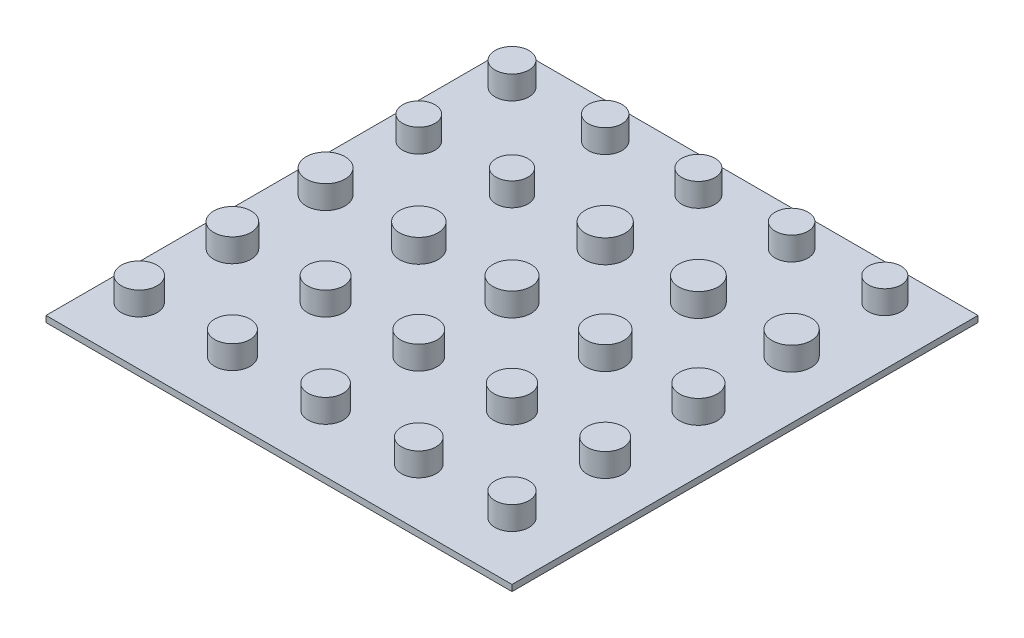
ISO-10303-21;
HEADER;
FILE_DESCRIPTION(('STEP AP214'),'2;1');
FILE_NAME('part.step','',(''),(''),'','','');
FILE_SCHEMA(('AUTOMOTIVE_DESIGN { 1 0 10303 214 1 1 1 1 }'));
ENDSEC;
DATA;
#1=APPLICATION_CONTEXT('core data for automotive mechanical design processes');
#2=APPLICATION_PROTOCOL_DEFINITION('international standard','automotive_design',2000,#1);
#3=PRODUCT_CONTEXT('',#1,'mechanical');
#4=PRODUCT('Part','Part','',(#3));
#5=PRODUCT_RELATED_PRODUCT_CATEGORY('part','',(#4));
#6=PRODUCT_DEFINITION_FORMATION('','',#4);
#7=PRODUCT_DEFINITION_CONTEXT('part definition',#1,'design');
#8=PRODUCT_DEFINITION('design','',#6,#7);
#9=PRODUCT_DEFINITION_SHAPE('','',#8);
#10=(LENGTH_UNIT() NAMED_UNIT(*) SI_UNIT(.MILLI.,.METRE.));
#11=(NAMED_UNIT(*) PLANE_ANGLE_UNIT() SI_UNIT($,.RADIAN.));
#12=(NAMED_UNIT(*) SI_UNIT($,.STERADIAN.) SOLID_ANGLE_UNIT());
#13=UNCERTAINTY_MEASURE_WITH_UNIT(LENGTH_MEASURE(1.E-05),#10,'distance_accuracy_value','');
#14=(GEOMETRIC_REPRESENTATION_CONTEXT(3) GLOBAL_UNCERTAINTY_ASSIGNED_CONTEXT((#13)) GLOBAL_UNIT_ASSIGNED_CONTEXT((#10,
#11,#12)) REPRESENTATION_CONTEXT('',''));
#15=CARTESIAN_POINT('',(0.,0.,0.));
#16=DIRECTION('',(0.,0.,1.));
#17=DIRECTION('',(1.,0.,0.));
#18=AXIS2_PLACEMENT_3D('',#15,#16,#17);
#19=CARTESIAN_POINT('',(-19.05,0.508,19.05));
#20=DIRECTION('',(1.,0.,0.));
#21=DIRECTION('',(0.,0.,-1.));
#22=AXIS2_PLACEMENT_3D('',#19,#20,#21);
#23=PLANE('',#22);
#24=DIRECTION('',(0.,0.,1.));
#25=VECTOR('',#24,1.);
#26=CARTESIAN_POINT('',(-19.05,0.,19.05));
#27=LINE('',#26,#25);
#28=CARTESIAN_POINT('',(-19.05,0.,-19.05));
#29=VERTEX_POINT('',#28);
#30=CARTESIAN_POINT('',(-19.05,0.,19.05));
#31=VERTEX_POINT('',#30);
#32=EDGE_CURVE('E100',#29,#31,#27,.T.);
#33=ORIENTED_EDGE('',*,*,#32,.T.);
#34=DIRECTION('',(0.,-1.,0.));
#35=VECTOR('',#34,1.);
#36=CARTESIAN_POINT('',(-19.05,0.508,19.05));
#37=LINE('',#36,#35);
#38=CARTESIAN_POINT('',(-19.05,0.508,19.05));
#39=VERTEX_POINT('',#38);
#40=EDGE_CURVE('E11',#39,#31,#37,.T.);
#41=ORIENTED_EDGE('',*,*,#40,.F.);
#42=DIRECTION('',(0.,0.,1.));
#43=VECTOR('',#42,1.);
#44=CARTESIAN_POINT('',(-19.05,0.508,19.05));
#45=LINE('',#44,#43);
#46=CARTESIAN_POINT('',(-19.05,0.508,-19.05));
#47=VERTEX_POINT('',#46);
#48=EDGE_CURVE('E88',#47,#39,#45,.T.);
#49=ORIENTED_EDGE('',*,*,#48,.F.);
#50=DIRECTION('',(0.,-1.,0.));
#51=VECTOR('',#50,1.);
#52=CARTESIAN_POINT('',(-19.05,0.508,-19.05));
#53=LINE('',#52,#51);
#54=EDGE_CURVE('E96',#47,#29,#53,.T.);
#55=ORIENTED_EDGE('',*,*,#54,.T.);
#56=EDGE_LOOP('',(#33,#41,#49,#55));
#57=FACE_BOUND('',#56,.T.);
#58=ADVANCED_FACE('F37',(#57),#23,.F.);
#59=CARTESIAN_POINT('',(19.05,0.508,19.05));
#60=DIRECTION('',(0.,0.,-1.));
#61=DIRECTION('',(-1.,0.,0.));
#62=AXIS2_PLACEMENT_3D('',#59,#60,#61);
#63=PLANE('',#62);
#64=DIRECTION('',(1.,0.,0.));
#65=VECTOR('',#64,1.);
#66=CARTESIAN_POINT('',(19.05,0.,19.05));
#67=LINE('',#66,#65);
#68=CARTESIAN_POINT('',(19.05,0.,19.05));
#69=VERTEX_POINT('',#68);
#70=EDGE_CURVE('E92',#31,#69,#67,.T.);
#71=ORIENTED_EDGE('',*,*,#70,.T.);
#72=DIRECTION('',(0.,-1.,0.));
#73=VECTOR('',#72,1.);
#74=CARTESIAN_POINT('',(19.05,0.508,19.05));
#75=LINE('',#74,#73);
#76=CARTESIAN_POINT('',(19.05,0.508,19.05));
#77=VERTEX_POINT('',#76);
#78=EDGE_CURVE('E45',#77,#69,#75,.T.);
#79=ORIENTED_EDGE('',*,*,#78,.F.);
#80=DIRECTION('',(1.,0.,0.));
#81=VECTOR('',#80,1.);
#82=CARTESIAN_POINT('',(19.05,0.508,19.05));
#83=LINE('',#82,#81);
#84=EDGE_CURVE('E83',#39,#77,#83,.T.);
#85=ORIENTED_EDGE('',*,*,#84,.F.);
#86=ORIENTED_EDGE('',*,*,#40,.T.);
#87=EDGE_LOOP('',(#71,#79,#85,#86));
#88=FACE_BOUND('',#87,.T.);
#89=ADVANCED_FACE('F91',(#88),#63,.F.);
#90=CARTESIAN_POINT('',(19.05,0.508,19.05));
#91=DIRECTION('',(-1.,0.,0.));
#92=DIRECTION('',(0.,0.,1.));
#93=AXIS2_PLACEMENT_3D('',#90,#91,#92);
#94=PLANE('',#93);
#95=DIRECTION('',(0.,0.,-1.));
#96=VECTOR('',#95,1.);
#97=CARTESIAN_POINT('',(19.05,0.,19.05));
#98=LINE('',#97,#96);
#99=CARTESIAN_POINT('',(19.05,0.,-19.05));
#100=VERTEX_POINT('',#99);
#101=EDGE_CURVE('E70',#69,#100,#98,.T.);
#102=ORIENTED_EDGE('',*,*,#101,.T.);
#103=DIRECTION('',(0.,-1.,0.));
#104=VECTOR('',#103,1.);
#105=CARTESIAN_POINT('',(19.05,0.508,-19.05));
#106=LINE('',#105,#104);
#107=CARTESIAN_POINT('',(19.05,0.508,-19.05));
#108=VERTEX_POINT('',#107);
#109=EDGE_CURVE('E93',#108,#100,#106,.T.);
#110=ORIENTED_EDGE('',*,*,#109,.F.);
#111=DIRECTION('',(0.,0.,-1.));
#112=VECTOR('',#111,1.);
#113=CARTESIAN_POINT('',(19.05,0.508,19.05));
#114=LINE('',#113,#112);
#115=EDGE_CURVE('E86',#77,#108,#114,.T.);
#116=ORIENTED_EDGE('',*,*,#115,.F.);
#117=ORIENTED_EDGE('',*,*,#78,.T.);
#118=EDGE_LOOP('',(#102,#110,#116,#117));
#119=FACE_BOUND('',#118,.T.);
#120=ADVANCED_FACE('F94',(#119),#94,.F.);
#121=CARTESIAN_POINT('',(19.05,0.508,-19.05));
#122=DIRECTION('',(0.,0.,1.));
#123=DIRECTION('',(1.,0.,0.));
#124=AXIS2_PLACEMENT_3D('',#121,#122,#123);
#125=PLANE('',#124);
#126=DIRECTION('',(-1.,0.,0.));
#127=VECTOR('',#126,1.);
#128=CARTESIAN_POINT('',(19.05,0.,-19.05));
#129=LINE('',#128,#127);
#130=EDGE_CURVE('E76',#100,#29,#129,.T.);
#131=ORIENTED_EDGE('',*,*,#130,.T.);
#132=ORIENTED_EDGE('',*,*,#54,.F.);
#133=DIRECTION('',(-1.,0.,0.));
#134=VECTOR('',#133,1.);
#135=CARTESIAN_POINT('',(19.05,0.508,-19.05));
#136=LINE('',#135,#134);
#137=EDGE_CURVE('E53',#108,#47,#136,.T.);
#138=ORIENTED_EDGE('',*,*,#137,.F.);
#139=ORIENTED_EDGE('',*,*,#109,.T.);
#140=EDGE_LOOP('',(#131,#132,#138,#139));
#141=FACE_BOUND('',#140,.T.);
#142=ADVANCED_FACE('F108',(#141),#125,.F.);
#143=CARTESIAN_POINT('',(0.,0.508,0.));
#144=DIRECTION('',(0.,1.,0.));
#145=DIRECTION('',(0.,0.,1.));
#146=AXIS2_PLACEMENT_3D('',#143,#144,#145);
#147=PLANE('',#146);
#148=CARTESIAN_POINT('',(-16.1633284680846,0.508,14.3166715319151));
#149=DIRECTION('',(0.,1.,0.));
#150=DIRECTION('',(0.,0.,1.));
#151=AXIS2_PLACEMENT_3D('',#148,#149,#150);
#152=CIRCLE('',#151,1.4605);
#153=CARTESIAN_POINT('',(-16.1633284680846,0.508,15.7771715319151));
#154=VERTEX_POINT('',#153);
#155=EDGE_CURVE('E258',#154,#154,#152,.T.);
#156=ORIENTED_EDGE('',*,*,#155,.F.);
#157=EDGE_LOOP('',(#156));
#158=FACE_BOUND('',#157,.T.);
#159=CARTESIAN_POINT('',(-16.1633284680847,0.508,6.69667153191509));
#160=DIRECTION('',(0.,1.,0.));
#161=DIRECTION('',(0.,0.,1.));
#162=AXIS2_PLACEMENT_3D('',#159,#160,#161);
#163=CIRCLE('',#162,1.524);
#164=CARTESIAN_POINT('',(-16.1633284680847,0.508,8.22067153191509));
#165=VERTEX_POINT('',#164);
#166=EDGE_CURVE('E252',#165,#165,#163,.T.);
#167=ORIENTED_EDGE('',*,*,#166,.F.);
#168=EDGE_LOOP('',(#167));
#169=FACE_BOUND('',#168,.T.);
#170=CARTESIAN_POINT('',(-16.1633284680847,0.508,-0.923328468084907));
#171=DIRECTION('',(0.,1.,0.));
#172=DIRECTION('',(0.,0.,1.));
#173=AXIS2_PLACEMENT_3D('',#170,#171,#172);
#174=CIRCLE('',#173,1.5875);
#175=CARTESIAN_POINT('',(-16.1633284680847,0.508,0.664171531915094));
#176=VERTEX_POINT('',#175);
#177=EDGE_CURVE('E246',#176,#176,#174,.T.);
#178=ORIENTED_EDGE('',*,*,#177,.F.);
#179=EDGE_LOOP('',(#178));
#180=FACE_BOUND('',#179,.T.);
#181=CARTESIAN_POINT('',(-16.1633284680848,0.508,-8.54332846808491));
#182=DIRECTION('',(0.,1.,0.));
#183=DIRECTION('',(0.,0.,1.));
#184=AXIS2_PLACEMENT_3D('',#181,#182,#183);
#185=CIRCLE('',#184,1.3208);
#186=CARTESIAN_POINT('',(-16.1633284680848,0.508,-7.22252846808491));
#187=VERTEX_POINT('',#186);
#188=EDGE_CURVE('E240',#187,#187,#185,.T.);
#189=ORIENTED_EDGE('',*,*,#188,.F.);
#190=EDGE_LOOP('',(#189));
#191=FACE_BOUND('',#190,.T.);
#192=CARTESIAN_POINT('',(14.3166715319154,0.508,14.3166715319151));
#193=DIRECTION('',(0.,1.,0.));
#194=DIRECTION('',(0.,0.,1.));
#195=AXIS2_PLACEMENT_3D('',#192,#193,#194);
#196=CIRCLE('',#195,1.397);
#197=CARTESIAN_POINT('',(14.3166715319154,0.508,15.7136715319151));
#198=VERTEX_POINT('',#197);
#199=EDGE_CURVE('E234',#198,#198,#196,.T.);
#200=ORIENTED_EDGE('',*,*,#199,.F.);
#201=EDGE_LOOP('',(#200));
#202=FACE_BOUND('',#201,.T.);
#203=CARTESIAN_POINT('',(6.69667153191541,0.508,14.3166715319151));
#204=DIRECTION('',(0.,1.,0.));
#205=DIRECTION('',(0.,0.,1.));
#206=AXIS2_PLACEMENT_3D('',#203,#204,#205);
#207=CIRCLE('',#206,1.4097);
#208=CARTESIAN_POINT('',(6.69667153191541,0.508,15.7263715319151));
#209=VERTEX_POINT('',#208);
#210=EDGE_CURVE('E228',#209,#209,#207,.T.);
#211=ORIENTED_EDGE('',*,*,#210,.F.);
#212=EDGE_LOOP('',(#211));
#213=FACE_BOUND('',#212,.T.);
#214=CARTESIAN_POINT('',(-0.923328468084589,0.508,14.3166715319151));
#215=DIRECTION('',(0.,1.,0.));
#216=DIRECTION('',(0.,0.,1.));
#217=AXIS2_PLACEMENT_3D('',#214,#215,#216);
#218=CIRCLE('',#217,1.4351);
#219=CARTESIAN_POINT('',(-0.923328468084589,0.508,15.7517715319151));
#220=VERTEX_POINT('',#219);
#221=EDGE_CURVE('E222',#220,#220,#218,.T.);
#222=ORIENTED_EDGE('',*,*,#221,.F.);
#223=EDGE_LOOP('',(#222));
#224=FACE_BOUND('',#223,.T.);
#225=CARTESIAN_POINT('',(-8.54332846808459,0.508,14.3166715319151));
#226=DIRECTION('',(0.,1.,0.));
#227=DIRECTION('',(0.,0.,1.));
#228=AXIS2_PLACEMENT_3D('',#225,#226,#227);
#229=CIRCLE('',#228,1.4478);
#230=CARTESIAN_POINT('',(-8.54332846808459,0.508,15.7644715319151));
#231=VERTEX_POINT('',#230);
#232=EDGE_CURVE('E216',#231,#231,#229,.T.);
#233=ORIENTED_EDGE('',*,*,#232,.F.);
#234=EDGE_LOOP('',(#233));
#235=FACE_BOUND('',#234,.T.);
#236=CARTESIAN_POINT('',(14.3166715319153,0.508,6.69667153191509));
#237=DIRECTION('',(0.,1.,0.));
#238=DIRECTION('',(0.,0.,1.));
#239=AXIS2_PLACEMENT_3D('',#236,#237,#238);
#240=CIRCLE('',#239,1.4732);
#241=CARTESIAN_POINT('',(14.3166715319153,0.508,8.16987153191509));
#242=VERTEX_POINT('',#241);
#243=EDGE_CURVE('E210',#242,#242,#240,.T.);
#244=ORIENTED_EDGE('',*,*,#243,.F.);
#245=EDGE_LOOP('',(#244));
#246=FACE_BOUND('',#245,.T.);
#247=CARTESIAN_POINT('',(6.69667153191533,0.508,6.69667153191509));
#248=DIRECTION('',(0.,1.,0.));
#249=DIRECTION('',(0.,0.,1.));
#250=AXIS2_PLACEMENT_3D('',#247,#248,#249);
#251=CIRCLE('',#250,1.4859);
#252=CARTESIAN_POINT('',(6.69667153191533,0.508,8.18257153191509));
#253=VERTEX_POINT('',#252);
#254=EDGE_CURVE('E204',#253,#253,#251,.T.);
#255=ORIENTED_EDGE('',*,*,#254,.F.);
#256=EDGE_LOOP('',(#255));
#257=FACE_BOUND('',#256,.T.);
#258=CARTESIAN_POINT('',(-0.923328468084669,0.508,6.69667153191509));
#259=DIRECTION('',(0.,1.,0.));
#260=DIRECTION('',(0.,0.,1.));
#261=AXIS2_PLACEMENT_3D('',#258,#259,#260);
#262=CIRCLE('',#261,1.4986);
#263=CARTESIAN_POINT('',(-0.923328468084669,0.508,8.19527153191509));
#264=VERTEX_POINT('',#263);
#265=EDGE_CURVE('E198',#264,#264,#262,.T.);
#266=ORIENTED_EDGE('',*,*,#265,.F.);
#267=EDGE_LOOP('',(#266));
#268=FACE_BOUND('',#267,.T.);
#269=CARTESIAN_POINT('',(-8.54332846808467,0.508,6.69667153191509));
#270=DIRECTION('',(0.,1.,0.));
#271=DIRECTION('',(0.,0.,1.));
#272=AXIS2_PLACEMENT_3D('',#269,#270,#271);
#273=CIRCLE('',#272,1.4732);
#274=CARTESIAN_POINT('',(-8.54332846808467,0.508,8.16987153191509));
#275=VERTEX_POINT('',#274);
#276=EDGE_CURVE('E192',#275,#275,#273,.T.);
#277=ORIENTED_EDGE('',*,*,#276,.F.);
#278=EDGE_LOOP('',(#277));
#279=FACE_BOUND('',#278,.T.);
#280=CARTESIAN_POINT('',(14.3166715319153,0.508,-0.923328468084907));
#281=DIRECTION('',(0.,1.,0.));
#282=DIRECTION('',(0.,0.,1.));
#283=AXIS2_PLACEMENT_3D('',#280,#281,#282);
#284=CIRCLE('',#283,1.5367);
#285=CARTESIAN_POINT('',(14.3166715319153,0.508,0.613371531915093));
#286=VERTEX_POINT('',#285);
#287=EDGE_CURVE('E186',#286,#286,#284,.T.);
#288=ORIENTED_EDGE('',*,*,#287,.F.);
#289=EDGE_LOOP('',(#288));
#290=FACE_BOUND('',#289,.T.);
#291=CARTESIAN_POINT('',(6.69667153191525,0.508,-0.923328468084907));
#292=DIRECTION('',(0.,1.,0.));
#293=DIRECTION('',(0.,0.,1.));
#294=AXIS2_PLACEMENT_3D('',#291,#292,#293);
#295=CIRCLE('',#294,1.5494);
#296=CARTESIAN_POINT('',(6.69667153191525,0.508,0.626071531915093));
#297=VERTEX_POINT('',#296);
#298=EDGE_CURVE('E180',#297,#297,#295,.T.);
#299=ORIENTED_EDGE('',*,*,#298,.F.);
#300=EDGE_LOOP('',(#299));
#301=FACE_BOUND('',#300,.T.);
#302=CARTESIAN_POINT('',(-0.923328468084749,0.508,-0.923328468084907));
#303=DIRECTION('',(0.,1.,0.));
#304=DIRECTION('',(0.,0.,1.));
#305=AXIS2_PLACEMENT_3D('',#302,#303,#304);
#306=CIRCLE('',#305,1.5621);
#307=CARTESIAN_POINT('',(-0.923328468084749,0.508,0.638771531915093));
#308=VERTEX_POINT('',#307);
#309=EDGE_CURVE('E174',#308,#308,#306,.T.);
#310=ORIENTED_EDGE('',*,*,#309,.F.);
#311=EDGE_LOOP('',(#310));
#312=FACE_BOUND('',#311,.T.);
#313=CARTESIAN_POINT('',(-8.54332846808475,0.508,-0.923328468084907));
#314=DIRECTION('',(0.,1.,0.));
#315=DIRECTION('',(0.,0.,1.));
#316=AXIS2_PLACEMENT_3D('',#313,#314,#315);
#317=CIRCLE('',#316,1.5748);
#318=CARTESIAN_POINT('',(-8.54332846808475,0.508,0.651471531915092));
#319=VERTEX_POINT('',#318);
#320=EDGE_CURVE('E168',#319,#319,#317,.T.);
#321=ORIENTED_EDGE('',*,*,#320,.F.);
#322=EDGE_LOOP('',(#321));
#323=FACE_BOUND('',#322,.T.);
#324=CARTESIAN_POINT('',(14.3166715319152,0.508,-8.54332846808491));
#325=DIRECTION('',(0.,1.,0.));
#326=DIRECTION('',(0.,0.,1.));
#327=AXIS2_PLACEMENT_3D('',#324,#325,#326);
#328=CIRCLE('',#327,1.6002);
#329=CARTESIAN_POINT('',(14.3166715319152,0.508,-6.94312846808491));
#330=VERTEX_POINT('',#329);
#331=EDGE_CURVE('E162',#330,#330,#328,.T.);
#332=ORIENTED_EDGE('',*,*,#331,.F.);
#333=EDGE_LOOP('',(#332));
#334=FACE_BOUND('',#333,.T.);
#335=CARTESIAN_POINT('',(6.69667153191517,0.508,-8.54332846808491));
#336=DIRECTION('',(0.,1.,0.));
#337=DIRECTION('',(0.,0.,1.));
#338=AXIS2_PLACEMENT_3D('',#335,#336,#337);
#339=CIRCLE('',#338,1.6129);
#340=CARTESIAN_POINT('',(6.69667153191517,0.508,-6.93042846808491));
#341=VERTEX_POINT('',#340);
#342=EDGE_CURVE('E156',#341,#341,#339,.T.);
#343=ORIENTED_EDGE('',*,*,#342,.F.);
#344=EDGE_LOOP('',(#343));
#345=FACE_BOUND('',#344,.T.);
#346=CARTESIAN_POINT('',(-0.923328468084827,0.508,-8.54332846808491));
#347=DIRECTION('',(0.,1.,0.));
#348=DIRECTION('',(0.,0.,1.));
#349=AXIS2_PLACEMENT_3D('',#346,#347,#348);
#350=CIRCLE('',#349,1.6256);
#351=CARTESIAN_POINT('',(-0.923328468084827,0.508,-6.91772846808491));
#352=VERTEX_POINT('',#351);
#353=EDGE_CURVE('E150',#352,#352,#350,.T.);
#354=ORIENTED_EDGE('',*,*,#353,.F.);
#355=EDGE_LOOP('',(#354));
#356=FACE_BOUND('',#355,.T.);
#357=CARTESIAN_POINT('',(-8.54332846808483,0.508,-8.54332846808491));
#358=DIRECTION('',(0.,1.,0.));
#359=DIRECTION('',(0.,0.,1.));
#360=AXIS2_PLACEMENT_3D('',#357,#358,#359);
#361=CIRCLE('',#360,1.3081);
#362=CARTESIAN_POINT('',(-8.54332846808483,0.508,-7.23522846808491));
#363=VERTEX_POINT('',#362);
#364=EDGE_CURVE('E144',#363,#363,#361,.T.);
#365=ORIENTED_EDGE('',*,*,#364,.F.);
#366=EDGE_LOOP('',(#365));
#367=FACE_BOUND('',#366,.T.);
#368=CARTESIAN_POINT('',(14.3166715319151,0.508,-16.1633284680849));
#369=DIRECTION('',(0.,1.,0.));
#370=DIRECTION('',(0.,0.,1.));
#371=AXIS2_PLACEMENT_3D('',#368,#369,#370);
#372=CIRCLE('',#371,1.3335);
#373=CARTESIAN_POINT('',(14.3166715319151,0.508,-14.8298284680849));
#374=VERTEX_POINT('',#373);
#375=EDGE_CURVE('E138',#374,#374,#372,.T.);
#376=ORIENTED_EDGE('',*,*,#375,.F.);
#377=EDGE_LOOP('',(#376));
#378=FACE_BOUND('',#377,.T.);
#379=CARTESIAN_POINT('',(6.69667153191509,0.508,-16.1633284680849));
#380=DIRECTION('',(0.,1.,0.));
#381=DIRECTION('',(0.,0.,1.));
#382=AXIS2_PLACEMENT_3D('',#379,#380,#381);
#383=CIRCLE('',#382,1.3462);
#384=CARTESIAN_POINT('',(6.69667153191509,0.508,-14.8171284680849));
#385=VERTEX_POINT('',#384);
#386=EDGE_CURVE('E132',#385,#385,#383,.T.);
#387=ORIENTED_EDGE('',*,*,#386,.F.);
#388=EDGE_LOOP('',(#387));
#389=FACE_BOUND('',#388,.T.);
#390=CARTESIAN_POINT('',(-0.923328468084907,0.508,-16.1633284680849));
#391=DIRECTION('',(0.,1.,0.));
#392=DIRECTION('',(0.,0.,1.));
#393=AXIS2_PLACEMENT_3D('',#390,#391,#392);
#394=CIRCLE('',#393,1.3589);
#395=CARTESIAN_POINT('',(-0.923328468084907,0.508,-14.8044284680849));
#396=VERTEX_POINT('',#395);
#397=EDGE_CURVE('E126',#396,#396,#394,.T.);
#398=ORIENTED_EDGE('',*,*,#397,.F.);
#399=EDGE_LOOP('',(#398));
#400=FACE_BOUND('',#399,.T.);
#401=CARTESIAN_POINT('',(-8.54332846808491,0.508,-16.1633284680849));
#402=DIRECTION('',(0.,1.,0.));
#403=DIRECTION('',(0.,0.,1.));
#404=AXIS2_PLACEMENT_3D('',#401,#402,#403);
#405=CIRCLE('',#404,1.3716);
#406=CARTESIAN_POINT('',(-8.54332846808491,0.508,-14.7917284680849));
#407=VERTEX_POINT('',#406);
#408=EDGE_CURVE('E120',#407,#407,#405,.T.);
#409=ORIENTED_EDGE('',*,*,#408,.F.);
#410=EDGE_LOOP('',(#409));
#411=FACE_BOUND('',#410,.T.);
#412=CARTESIAN_POINT('',(-16.1633284680849,0.508,-16.1633284680849));
#413=DIRECTION('',(0.,1.,0.));
#414=DIRECTION('',(0.,0.,1.));
#415=AXIS2_PLACEMENT_3D('',#412,#413,#414);
#416=CIRCLE('',#415,1.3843);
#417=CARTESIAN_POINT('',(-16.1633284680849,0.508,-14.7790284680849));
#418=VERTEX_POINT('',#417);
#419=EDGE_CURVE('E114',#418,#418,#416,.T.);
#420=ORIENTED_EDGE('',*,*,#419,.F.);
#421=EDGE_LOOP('',(#420));
#422=FACE_BOUND('',#421,.T.);
#423=ORIENTED_EDGE('',*,*,#48,.T.);
#424=ORIENTED_EDGE('',*,*,#84,.T.);
#425=ORIENTED_EDGE('',*,*,#115,.T.);
#426=ORIENTED_EDGE('',*,*,#137,.T.);
#427=EDGE_LOOP('',(#423,#424,#425,#426));
#428=FACE_BOUND('',#427,.T.);
#429=ADVANCED_FACE('F84',(#158,#169,#180,#191,#202,#213,#224,#235,#246,#257,#268,#279,#290,#301,
#312,#323,#334,#345,#356,#367,#378,#389,#400,#411,#422,#428),#147,.T.);
#430=CARTESIAN_POINT('',(0.,0.,0.));
#431=DIRECTION('',(0.,1.,0.));
#432=DIRECTION('',(0.,0.,1.));
#433=AXIS2_PLACEMENT_3D('',#430,#431,#432);
#434=PLANE('',#433);
#435=ORIENTED_EDGE('',*,*,#32,.F.);
#436=ORIENTED_EDGE('',*,*,#130,.F.);
#437=ORIENTED_EDGE('',*,*,#101,.F.);
#438=ORIENTED_EDGE('',*,*,#70,.F.);
#439=EDGE_LOOP('',(#435,#436,#437,#438));
#440=FACE_BOUND('',#439,.T.);
#441=ADVANCED_FACE('F111',(#440),#434,.F.);
#442=CARTESIAN_POINT('',(-16.1633284680849,2.413,-16.1633284680849));
#443=DIRECTION('',(0.,-1.,0.));
#444=DIRECTION('',(0.,0.,-1.));
#445=AXIS2_PLACEMENT_3D('',#442,#443,#444);
#446=CYLINDRICAL_SURFACE('',#445,1.3843);
#447=CARTESIAN_POINT('',(-16.1633284680849,2.413,-16.1633284680849));
#448=DIRECTION('',(0.,1.,0.));
#449=DIRECTION('',(0.,0.,1.));
#450=AXIS2_PLACEMENT_3D('',#447,#448,#449);
#451=CIRCLE('',#450,1.3843);
#452=CARTESIAN_POINT('',(-16.1633284680849,2.413,-14.7790284680849));
#453=VERTEX_POINT('',#452);
#454=EDGE_CURVE('E103',#453,#453,#451,.T.);
#455=ORIENTED_EDGE('',*,*,#454,.F.);
#456=EDGE_LOOP('',(#455));
#457=FACE_BOUND('',#456,.T.);
#458=ORIENTED_EDGE('',*,*,#419,.T.);
#459=EDGE_LOOP('',(#458));
#460=FACE_BOUND('',#459,.T.);
#461=ADVANCED_FACE('F324',(#457,#460),#446,.T.);
#462=CARTESIAN_POINT('',(-16.1633284680849,2.413,-16.1633284680849));
#463=DIRECTION('',(0.,1.,0.));
#464=DIRECTION('',(0.,0.,1.));
#465=AXIS2_PLACEMENT_3D('',#462,#463,#464);
#466=PLANE('',#465);
#467=ORIENTED_EDGE('',*,*,#454,.T.);
#468=EDGE_LOOP('',(#467));
#469=FACE_BOUND('',#468,.T.);
#470=ADVANCED_FACE('F326',(#469),#466,.T.);
#471=CARTESIAN_POINT('',(-8.54332846808491,2.413,-16.1633284680849));
#472=DIRECTION('',(0.,-1.,0.));
#473=DIRECTION('',(0.,0.,-1.));
#474=AXIS2_PLACEMENT_3D('',#471,#472,#473);
#475=CYLINDRICAL_SURFACE('',#474,1.3716);
#476=CARTESIAN_POINT('',(-8.54332846808491,2.413,-16.1633284680849));
#477=DIRECTION('',(0.,1.,0.));
#478=DIRECTION('',(0.,0.,1.));
#479=AXIS2_PLACEMENT_3D('',#476,#477,#478);
#480=CIRCLE('',#479,1.3716);
#481=CARTESIAN_POINT('',(-8.54332846808491,2.413,-14.7917284680849));
#482=VERTEX_POINT('',#481);
#483=EDGE_CURVE('E117',#482,#482,#480,.T.);
#484=ORIENTED_EDGE('',*,*,#483,.F.);
#485=EDGE_LOOP('',(#484));
#486=FACE_BOUND('',#485,.T.);
#487=ORIENTED_EDGE('',*,*,#408,.T.);
#488=EDGE_LOOP('',(#487));
#489=FACE_BOUND('',#488,.T.);
#490=ADVANCED_FACE('F333',(#486,#489),#475,.T.);
#491=CARTESIAN_POINT('',(-8.54332846808491,2.413,-16.1633284680849));
#492=DIRECTION('',(0.,1.,0.));
#493=DIRECTION('',(0.,0.,1.));
#494=AXIS2_PLACEMENT_3D('',#491,#492,#493);
#495=PLANE('',#494);
#496=ORIENTED_EDGE('',*,*,#483,.T.);
#497=EDGE_LOOP('',(#496));
#498=FACE_BOUND('',#497,.T.);
#499=ADVANCED_FACE('F381',(#498),#495,.T.);
#500=CARTESIAN_POINT('',(-0.923328468084907,2.413,-16.1633284680849));
#501=DIRECTION('',(0.,-1.,0.));
#502=DIRECTION('',(0.,0.,-1.));
#503=AXIS2_PLACEMENT_3D('',#500,#501,#502);
#504=CYLINDRICAL_SURFACE('',#503,1.3589);
#505=CARTESIAN_POINT('',(-0.923328468084907,2.413,-16.1633284680849));
#506=DIRECTION('',(0.,1.,0.));
#507=DIRECTION('',(0.,0.,1.));
#508=AXIS2_PLACEMENT_3D('',#505,#506,#507);
#509=CIRCLE('',#508,1.3589);
#510=CARTESIAN_POINT('',(-0.923328468084907,2.413,-14.8044284680849));
#511=VERTEX_POINT('',#510);
#512=EDGE_CURVE('E123',#511,#511,#509,.T.);
#513=ORIENTED_EDGE('',*,*,#512,.F.);
#514=EDGE_LOOP('',(#513));
#515=FACE_BOUND('',#514,.T.);
#516=ORIENTED_EDGE('',*,*,#397,.T.);
#517=EDGE_LOOP('',(#516));
#518=FACE_BOUND('',#517,.T.);
#519=ADVANCED_FACE('F390',(#515,#518),#504,.T.);
#520=CARTESIAN_POINT('',(-0.923328468084907,2.413,-16.1633284680849));
#521=DIRECTION('',(0.,1.,0.));
#522=DIRECTION('',(0.,0.,1.));
#523=AXIS2_PLACEMENT_3D('',#520,#521,#522);
#524=PLANE('',#523);
#525=ORIENTED_EDGE('',*,*,#512,.T.);
#526=EDGE_LOOP('',(#525));
#527=FACE_BOUND('',#526,.T.);
#528=ADVANCED_FACE('F399',(#527),#524,.T.);
#529=CARTESIAN_POINT('',(6.69667153191509,2.413,-16.1633284680849));
#530=DIRECTION('',(0.,-1.,0.));
#531=DIRECTION('',(0.,0.,-1.));
#532=AXIS2_PLACEMENT_3D('',#529,#530,#531);
#533=CYLINDRICAL_SURFACE('',#532,1.3462);
#534=CARTESIAN_POINT('',(6.69667153191509,2.413,-16.1633284680849));
#535=DIRECTION('',(0.,1.,0.));
#536=DIRECTION('',(0.,0.,1.));
#537=AXIS2_PLACEMENT_3D('',#534,#535,#536);
#538=CIRCLE('',#537,1.3462);
#539=CARTESIAN_POINT('',(6.69667153191509,2.413,-14.8171284680849));
#540=VERTEX_POINT('',#539);
#541=EDGE_CURVE('E129',#540,#540,#538,.T.);
#542=ORIENTED_EDGE('',*,*,#541,.F.);
#543=EDGE_LOOP('',(#542));
#544=FACE_BOUND('',#543,.T.);
#545=ORIENTED_EDGE('',*,*,#386,.T.);
#546=EDGE_LOOP('',(#545));
#547=FACE_BOUND('',#546,.T.);
#548=ADVANCED_FACE('F408',(#544,#547),#533,.T.);
#549=CARTESIAN_POINT('',(6.69667153191509,2.413,-16.1633284680849));
#550=DIRECTION('',(0.,1.,0.));
#551=DIRECTION('',(0.,0.,1.));
#552=AXIS2_PLACEMENT_3D('',#549,#550,#551);
#553=PLANE('',#552);
#554=ORIENTED_EDGE('',*,*,#541,.T.);
#555=EDGE_LOOP('',(#554));
#556=FACE_BOUND('',#555,.T.);
#557=ADVANCED_FACE('F417',(#556),#553,.T.);
#558=CARTESIAN_POINT('',(14.3166715319151,2.413,-16.1633284680849));
#559=DIRECTION('',(0.,-1.,0.));
#560=DIRECTION('',(0.,0.,-1.));
#561=AXIS2_PLACEMENT_3D('',#558,#559,#560);
#562=CYLINDRICAL_SURFACE('',#561,1.3335);
#563=CARTESIAN_POINT('',(14.3166715319151,2.413,-16.1633284680849));
#564=DIRECTION('',(0.,1.,0.));
#565=DIRECTION('',(0.,0.,1.));
#566=AXIS2_PLACEMENT_3D('',#563,#564,#565);
#567=CIRCLE('',#566,1.3335);
#568=CARTESIAN_POINT('',(14.3166715319151,2.413,-14.8298284680849));
#569=VERTEX_POINT('',#568);
#570=EDGE_CURVE('E135',#569,#569,#567,.T.);
#571=ORIENTED_EDGE('',*,*,#570,.F.);
#572=EDGE_LOOP('',(#571));
#573=FACE_BOUND('',#572,.T.);
#574=ORIENTED_EDGE('',*,*,#375,.T.);
#575=EDGE_LOOP('',(#574));
#576=FACE_BOUND('',#575,.T.);
#577=ADVANCED_FACE('F426',(#573,#576),#562,.T.);
#578=CARTESIAN_POINT('',(14.3166715319151,2.413,-16.1633284680849));
#579=DIRECTION('',(0.,1.,0.));
#580=DIRECTION('',(0.,0.,1.));
#581=AXIS2_PLACEMENT_3D('',#578,#579,#580);
#582=PLANE('',#581);
#583=ORIENTED_EDGE('',*,*,#570,.T.);
#584=EDGE_LOOP('',(#583));
#585=FACE_BOUND('',#584,.T.);
#586=ADVANCED_FACE('F435',(#585),#582,.T.);
#587=CARTESIAN_POINT('',(-8.54332846808483,2.413,-8.54332846808491));
#588=DIRECTION('',(0.,-1.,0.));
#589=DIRECTION('',(0.,0.,-1.));
#590=AXIS2_PLACEMENT_3D('',#587,#588,#589);
#591=CYLINDRICAL_SURFACE('',#590,1.3081);
#592=CARTESIAN_POINT('',(-8.54332846808483,2.413,-8.54332846808491));
#593=DIRECTION('',(0.,1.,0.));
#594=DIRECTION('',(0.,0.,1.));
#595=AXIS2_PLACEMENT_3D('',#592,#593,#594);
#596=CIRCLE('',#595,1.3081);
#597=CARTESIAN_POINT('',(-8.54332846808483,2.413,-7.23522846808491));
#598=VERTEX_POINT('',#597);
#599=EDGE_CURVE('E141',#598,#598,#596,.T.);
#600=ORIENTED_EDGE('',*,*,#599,.F.);
#601=EDGE_LOOP('',(#600));
#602=FACE_BOUND('',#601,.T.);
#603=ORIENTED_EDGE('',*,*,#364,.T.);
#604=EDGE_LOOP('',(#603));
#605=FACE_BOUND('',#604,.T.);
#606=ADVANCED_FACE('F444',(#602,#605),#591,.T.);
#607=CARTESIAN_POINT('',(-8.54332846808483,2.413,-8.54332846808491));
#608=DIRECTION('',(0.,1.,0.));
#609=DIRECTION('',(0.,0.,1.));
#610=AXIS2_PLACEMENT_3D('',#607,#608,#609);
#611=PLANE('',#610);
#612=ORIENTED_EDGE('',*,*,#599,.T.);
#613=EDGE_LOOP('',(#612));
#614=FACE_BOUND('',#613,.T.);
#615=ADVANCED_FACE('F453',(#614),#611,.T.);
#616=CARTESIAN_POINT('',(-0.923328468084827,2.413,-8.54332846808491));
#617=DIRECTION('',(0.,-1.,0.));
#618=DIRECTION('',(0.,0.,-1.));
#619=AXIS2_PLACEMENT_3D('',#616,#617,#618);
#620=CYLINDRICAL_SURFACE('',#619,1.6256);
#621=CARTESIAN_POINT('',(-0.923328468084827,2.413,-8.54332846808491));
#622=DIRECTION('',(0.,1.,0.));
#623=DIRECTION('',(0.,0.,1.));
#624=AXIS2_PLACEMENT_3D('',#621,#622,#623);
#625=CIRCLE('',#624,1.6256);
#626=CARTESIAN_POINT('',(-0.923328468084827,2.413,-6.91772846808491));
#627=VERTEX_POINT('',#626);
#628=EDGE_CURVE('E147',#627,#627,#625,.T.);
#629=ORIENTED_EDGE('',*,*,#628,.F.);
#630=EDGE_LOOP('',(#629));
#631=FACE_BOUND('',#630,.T.);
#632=ORIENTED_EDGE('',*,*,#353,.T.);
#633=EDGE_LOOP('',(#632));
#634=FACE_BOUND('',#633,.T.);
#635=ADVANCED_FACE('F462',(#631,#634),#620,.T.);
#636=CARTESIAN_POINT('',(-0.923328468084827,2.413,-8.54332846808491));
#637=DIRECTION('',(0.,1.,0.));
#638=DIRECTION('',(0.,0.,1.));
#639=AXIS2_PLACEMENT_3D('',#636,#637,#638);
#640=PLANE('',#639);
#641=ORIENTED_EDGE('',*,*,#628,.T.);
#642=EDGE_LOOP('',(#641));
#643=FACE_BOUND('',#642,.T.);
#644=ADVANCED_FACE('F471',(#643),#640,.T.);
#645=CARTESIAN_POINT('',(6.69667153191517,2.413,-8.54332846808491));
#646=DIRECTION('',(0.,-1.,0.));
#647=DIRECTION('',(0.,0.,-1.));
#648=AXIS2_PLACEMENT_3D('',#645,#646,#647);
#649=CYLINDRICAL_SURFACE('',#648,1.6129);
#650=CARTESIAN_POINT('',(6.69667153191517,2.413,-8.54332846808491));
#651=DIRECTION('',(0.,1.,0.));
#652=DIRECTION('',(0.,0.,1.));
#653=AXIS2_PLACEMENT_3D('',#650,#651,#652);
#654=CIRCLE('',#653,1.6129);
#655=CARTESIAN_POINT('',(6.69667153191517,2.413,-6.93042846808491));
#656=VERTEX_POINT('',#655);
#657=EDGE_CURVE('E153',#656,#656,#654,.T.);
#658=ORIENTED_EDGE('',*,*,#657,.F.);
#659=EDGE_LOOP('',(#658));
#660=FACE_BOUND('',#659,.T.);
#661=ORIENTED_EDGE('',*,*,#342,.T.);
#662=EDGE_LOOP('',(#661));
#663=FACE_BOUND('',#662,.T.);
#664=ADVANCED_FACE('F480',(#660,#663),#649,.T.);
#665=CARTESIAN_POINT('',(6.69667153191517,2.413,-8.54332846808491));
#666=DIRECTION('',(0.,1.,0.));
#667=DIRECTION('',(0.,0.,1.));
#668=AXIS2_PLACEMENT_3D('',#665,#666,#667);
#669=PLANE('',#668);
#670=ORIENTED_EDGE('',*,*,#657,.T.);
#671=EDGE_LOOP('',(#670));
#672=FACE_BOUND('',#671,.T.);
#673=ADVANCED_FACE('F489',(#672),#669,.T.);
#674=CARTESIAN_POINT('',(14.3166715319152,2.413,-8.54332846808491));
#675=DIRECTION('',(0.,-1.,0.));
#676=DIRECTION('',(0.,0.,-1.));
#677=AXIS2_PLACEMENT_3D('',#674,#675,#676);
#678=CYLINDRICAL_SURFACE('',#677,1.6002);
#679=CARTESIAN_POINT('',(14.3166715319152,2.413,-8.54332846808491));
#680=DIRECTION('',(0.,1.,0.));
#681=DIRECTION('',(0.,0.,1.));
#682=AXIS2_PLACEMENT_3D('',#679,#680,#681);
#683=CIRCLE('',#682,1.6002);
#684=CARTESIAN_POINT('',(14.3166715319152,2.413,-6.94312846808491));
#685=VERTEX_POINT('',#684);
#686=EDGE_CURVE('E159',#685,#685,#683,.T.);
#687=ORIENTED_EDGE('',*,*,#686,.F.);
#688=EDGE_LOOP('',(#687));
#689=FACE_BOUND('',#688,.T.);
#690=ORIENTED_EDGE('',*,*,#331,.T.);
#691=EDGE_LOOP('',(#690));
#692=FACE_BOUND('',#691,.T.);
#693=ADVANCED_FACE('F498',(#689,#692),#678,.T.);
#694=CARTESIAN_POINT('',(14.3166715319152,2.413,-8.54332846808491));
#695=DIRECTION('',(0.,1.,0.));
#696=DIRECTION('',(0.,0.,1.));
#697=AXIS2_PLACEMENT_3D('',#694,#695,#696);
#698=PLANE('',#697);
#699=ORIENTED_EDGE('',*,*,#686,.T.);
#700=EDGE_LOOP('',(#699));
#701=FACE_BOUND('',#700,.T.);
#702=ADVANCED_FACE('F507',(#701),#698,.T.);
#703=CARTESIAN_POINT('',(-8.54332846808475,2.413,-0.923328468084907));
#704=DIRECTION('',(0.,-1.,0.));
#705=DIRECTION('',(0.,0.,-1.));
#706=AXIS2_PLACEMENT_3D('',#703,#704,#705);
#707=CYLINDRICAL_SURFACE('',#706,1.5748);
#708=CARTESIAN_POINT('',(-8.54332846808475,2.413,-0.923328468084907));
#709=DIRECTION('',(0.,1.,0.));
#710=DIRECTION('',(0.,0.,1.));
#711=AXIS2_PLACEMENT_3D('',#708,#709,#710);
#712=CIRCLE('',#711,1.5748);
#713=CARTESIAN_POINT('',(-8.54332846808475,2.413,0.651471531915092));
#714=VERTEX_POINT('',#713);
#715=EDGE_CURVE('E165',#714,#714,#712,.T.);
#716=ORIENTED_EDGE('',*,*,#715,.F.);
#717=EDGE_LOOP('',(#716));
#718=FACE_BOUND('',#717,.T.);
#719=ORIENTED_EDGE('',*,*,#320,.T.);
#720=EDGE_LOOP('',(#719));
#721=FACE_BOUND('',#720,.T.);
#722=ADVANCED_FACE('F516',(#718,#721),#707,.T.);
#723=CARTESIAN_POINT('',(-8.54332846808475,2.413,-0.923328468084907));
#724=DIRECTION('',(0.,1.,0.));
#725=DIRECTION('',(0.,0.,1.));
#726=AXIS2_PLACEMENT_3D('',#723,#724,#725);
#727=PLANE('',#726);
#728=ORIENTED_EDGE('',*,*,#715,.T.);
#729=EDGE_LOOP('',(#728));
#730=FACE_BOUND('',#729,.T.);
#731=ADVANCED_FACE('F525',(#730),#727,.T.);
#732=CARTESIAN_POINT('',(-0.923328468084749,2.413,-0.923328468084907));
#733=DIRECTION('',(0.,-1.,0.));
#734=DIRECTION('',(0.,0.,-1.));
#735=AXIS2_PLACEMENT_3D('',#732,#733,#734);
#736=CYLINDRICAL_SURFACE('',#735,1.5621);
#737=CARTESIAN_POINT('',(-0.923328468084749,2.413,-0.923328468084907));
#738=DIRECTION('',(0.,1.,0.));
#739=DIRECTION('',(0.,0.,1.));
#740=AXIS2_PLACEMENT_3D('',#737,#738,#739);
#741=CIRCLE('',#740,1.5621);
#742=CARTESIAN_POINT('',(-0.923328468084749,2.413,0.638771531915093));
#743=VERTEX_POINT('',#742);
#744=EDGE_CURVE('E171',#743,#743,#741,.T.);
#745=ORIENTED_EDGE('',*,*,#744,.F.);
#746=EDGE_LOOP('',(#745));
#747=FACE_BOUND('',#746,.T.);
#748=ORIENTED_EDGE('',*,*,#309,.T.);
#749=EDGE_LOOP('',(#748));
#750=FACE_BOUND('',#749,.T.);
#751=ADVANCED_FACE('F534',(#747,#750),#736,.T.);
#752=CARTESIAN_POINT('',(-0.923328468084749,2.413,-0.923328468084907));
#753=DIRECTION('',(0.,1.,0.));
#754=DIRECTION('',(0.,0.,1.));
#755=AXIS2_PLACEMENT_3D('',#752,#753,#754);
#756=PLANE('',#755);
#757=ORIENTED_EDGE('',*,*,#744,.T.);
#758=EDGE_LOOP('',(#757));
#759=FACE_BOUND('',#758,.T.);
#760=ADVANCED_FACE('F543',(#759),#756,.T.);
#761=CARTESIAN_POINT('',(6.69667153191525,2.413,-0.923328468084907));
#762=DIRECTION('',(0.,-1.,0.));
#763=DIRECTION('',(0.,0.,-1.));
#764=AXIS2_PLACEMENT_3D('',#761,#762,#763);
#765=CYLINDRICAL_SURFACE('',#764,1.5494);
#766=CARTESIAN_POINT('',(6.69667153191525,2.413,-0.923328468084907));
#767=DIRECTION('',(0.,1.,0.));
#768=DIRECTION('',(0.,0.,1.));
#769=AXIS2_PLACEMENT_3D('',#766,#767,#768);
#770=CIRCLE('',#769,1.5494);
#771=CARTESIAN_POINT('',(6.69667153191525,2.413,0.626071531915093));
#772=VERTEX_POINT('',#771);
#773=EDGE_CURVE('E177',#772,#772,#770,.T.);
#774=ORIENTED_EDGE('',*,*,#773,.F.);
#775=EDGE_LOOP('',(#774));
#776=FACE_BOUND('',#775,.T.);
#777=ORIENTED_EDGE('',*,*,#298,.T.);
#778=EDGE_LOOP('',(#777));
#779=FACE_BOUND('',#778,.T.);
#780=ADVANCED_FACE('F552',(#776,#779),#765,.T.);
#781=CARTESIAN_POINT('',(6.69667153191525,2.413,-0.923328468084907));
#782=DIRECTION('',(0.,1.,0.));
#783=DIRECTION('',(0.,0.,1.));
#784=AXIS2_PLACEMENT_3D('',#781,#782,#783);
#785=PLANE('',#784);
#786=ORIENTED_EDGE('',*,*,#773,.T.);
#787=EDGE_LOOP('',(#786));
#788=FACE_BOUND('',#787,.T.);
#789=ADVANCED_FACE('F561',(#788),#785,.T.);
#790=CARTESIAN_POINT('',(14.3166715319153,2.413,-0.923328468084907));
#791=DIRECTION('',(0.,-1.,0.));
#792=DIRECTION('',(0.,0.,-1.));
#793=AXIS2_PLACEMENT_3D('',#790,#791,#792);
#794=CYLINDRICAL_SURFACE('',#793,1.5367);
#795=CARTESIAN_POINT('',(14.3166715319153,2.413,-0.923328468084907));
#796=DIRECTION('',(0.,1.,0.));
#797=DIRECTION('',(0.,0.,1.));
#798=AXIS2_PLACEMENT_3D('',#795,#796,#797);
#799=CIRCLE('',#798,1.5367);
#800=CARTESIAN_POINT('',(14.3166715319153,2.413,0.613371531915093));
#801=VERTEX_POINT('',#800);
#802=EDGE_CURVE('E183',#801,#801,#799,.T.);
#803=ORIENTED_EDGE('',*,*,#802,.F.);
#804=EDGE_LOOP('',(#803));
#805=FACE_BOUND('',#804,.T.);
#806=ORIENTED_EDGE('',*,*,#287,.T.);
#807=EDGE_LOOP('',(#806));
#808=FACE_BOUND('',#807,.T.);
#809=ADVANCED_FACE('F570',(#805,#808),#794,.T.);
#810=CARTESIAN_POINT('',(14.3166715319153,2.413,-0.923328468084907));
#811=DIRECTION('',(0.,1.,0.));
#812=DIRECTION('',(0.,0.,1.));
#813=AXIS2_PLACEMENT_3D('',#810,#811,#812);
#814=PLANE('',#813);
#815=ORIENTED_EDGE('',*,*,#802,.T.);
#816=EDGE_LOOP('',(#815));
#817=FACE_BOUND('',#816,.T.);
#818=ADVANCED_FACE('F579',(#817),#814,.T.);
#819=CARTESIAN_POINT('',(-8.54332846808467,2.413,6.69667153191509));
#820=DIRECTION('',(0.,-1.,0.));
#821=DIRECTION('',(0.,0.,-1.));
#822=AXIS2_PLACEMENT_3D('',#819,#820,#821);
#823=CYLINDRICAL_SURFACE('',#822,1.4732);
#824=CARTESIAN_POINT('',(-8.54332846808467,2.413,6.69667153191509));
#825=DIRECTION('',(0.,1.,0.));
#826=DIRECTION('',(0.,0.,1.));
#827=AXIS2_PLACEMENT_3D('',#824,#825,#826);
#828=CIRCLE('',#827,1.4732);
#829=CARTESIAN_POINT('',(-8.54332846808467,2.413,8.16987153191509));
#830=VERTEX_POINT('',#829);
#831=EDGE_CURVE('E189',#830,#830,#828,.T.);
#832=ORIENTED_EDGE('',*,*,#831,.F.);
#833=EDGE_LOOP('',(#832));
#834=FACE_BOUND('',#833,.T.);
#835=ORIENTED_EDGE('',*,*,#276,.T.);
#836=EDGE_LOOP('',(#835));
#837=FACE_BOUND('',#836,.T.);
#838=ADVANCED_FACE('F588',(#834,#837),#823,.T.);
#839=CARTESIAN_POINT('',(-8.54332846808467,2.413,6.69667153191509));
#840=DIRECTION('',(0.,1.,0.));
#841=DIRECTION('',(0.,0.,1.));
#842=AXIS2_PLACEMENT_3D('',#839,#840,#841);
#843=PLANE('',#842);
#844=ORIENTED_EDGE('',*,*,#831,.T.);
#845=EDGE_LOOP('',(#844));
#846=FACE_BOUND('',#845,.T.);
#847=ADVANCED_FACE('F597',(#846),#843,.T.);
#848=CARTESIAN_POINT('',(-0.923328468084669,2.413,6.69667153191509));
#849=DIRECTION('',(0.,-1.,0.));
#850=DIRECTION('',(0.,0.,-1.));
#851=AXIS2_PLACEMENT_3D('',#848,#849,#850);
#852=CYLINDRICAL_SURFACE('',#851,1.4986);
#853=CARTESIAN_POINT('',(-0.923328468084669,2.413,6.69667153191509));
#854=DIRECTION('',(0.,1.,0.));
#855=DIRECTION('',(0.,0.,1.));
#856=AXIS2_PLACEMENT_3D('',#853,#854,#855);
#857=CIRCLE('',#856,1.4986);
#858=CARTESIAN_POINT('',(-0.923328468084669,2.413,8.19527153191509));
#859=VERTEX_POINT('',#858);
#860=EDGE_CURVE('E195',#859,#859,#857,.T.);
#861=ORIENTED_EDGE('',*,*,#860,.F.);
#862=EDGE_LOOP('',(#861));
#863=FACE_BOUND('',#862,.T.);
#864=ORIENTED_EDGE('',*,*,#265,.T.);
#865=EDGE_LOOP('',(#864));
#866=FACE_BOUND('',#865,.T.);
#867=ADVANCED_FACE('F606',(#863,#866),#852,.T.);
#868=CARTESIAN_POINT('',(-0.923328468084669,2.413,6.69667153191509));
#869=DIRECTION('',(0.,1.,0.));
#870=DIRECTION('',(0.,0.,1.));
#871=AXIS2_PLACEMENT_3D('',#868,#869,#870);
#872=PLANE('',#871);
#873=ORIENTED_EDGE('',*,*,#860,.T.);
#874=EDGE_LOOP('',(#873));
#875=FACE_BOUND('',#874,.T.);
#876=ADVANCED_FACE('F615',(#875),#872,.T.);
#877=CARTESIAN_POINT('',(6.69667153191533,2.413,6.69667153191509));
#878=DIRECTION('',(0.,-1.,0.));
#879=DIRECTION('',(0.,0.,-1.));
#880=AXIS2_PLACEMENT_3D('',#877,#878,#879);
#881=CYLINDRICAL_SURFACE('',#880,1.4859);
#882=CARTESIAN_POINT('',(6.69667153191533,2.413,6.69667153191509));
#883=DIRECTION('',(0.,1.,0.));
#884=DIRECTION('',(0.,0.,1.));
#885=AXIS2_PLACEMENT_3D('',#882,#883,#884);
#886=CIRCLE('',#885,1.4859);
#887=CARTESIAN_POINT('',(6.69667153191533,2.413,8.18257153191509));
#888=VERTEX_POINT('',#887);
#889=EDGE_CURVE('E201',#888,#888,#886,.T.);
#890=ORIENTED_EDGE('',*,*,#889,.F.);
#891=EDGE_LOOP('',(#890));
#892=FACE_BOUND('',#891,.T.);
#893=ORIENTED_EDGE('',*,*,#254,.T.);
#894=EDGE_LOOP('',(#893));
#895=FACE_BOUND('',#894,.T.);
#896=ADVANCED_FACE('F624',(#892,#895),#881,.T.);
#897=CARTESIAN_POINT('',(6.69667153191533,2.413,6.69667153191509));
#898=DIRECTION('',(0.,1.,0.));
#899=DIRECTION('',(0.,0.,1.));
#900=AXIS2_PLACEMENT_3D('',#897,#898,#899);
#901=PLANE('',#900);
#902=ORIENTED_EDGE('',*,*,#889,.T.);
#903=EDGE_LOOP('',(#902));
#904=FACE_BOUND('',#903,.T.);
#905=ADVANCED_FACE('F633',(#904),#901,.T.);
#906=CARTESIAN_POINT('',(14.3166715319153,2.413,6.69667153191509));
#907=DIRECTION('',(0.,-1.,0.));
#908=DIRECTION('',(0.,0.,-1.));
#909=AXIS2_PLACEMENT_3D('',#906,#907,#908);
#910=CYLINDRICAL_SURFACE('',#909,1.4732);
#911=CARTESIAN_POINT('',(14.3166715319153,2.413,6.69667153191509));
#912=DIRECTION('',(0.,1.,0.));
#913=DIRECTION('',(0.,0.,1.));
#914=AXIS2_PLACEMENT_3D('',#911,#912,#913);
#915=CIRCLE('',#914,1.4732);
#916=CARTESIAN_POINT('',(14.3166715319153,2.413,8.16987153191509));
#917=VERTEX_POINT('',#916);
#918=EDGE_CURVE('E207',#917,#917,#915,.T.);
#919=ORIENTED_EDGE('',*,*,#918,.F.);
#920=EDGE_LOOP('',(#919));
#921=FACE_BOUND('',#920,.T.);
#922=ORIENTED_EDGE('',*,*,#243,.T.);
#923=EDGE_LOOP('',(#922));
#924=FACE_BOUND('',#923,.T.);
#925=ADVANCED_FACE('F642',(#921,#924),#910,.T.);
#926=CARTESIAN_POINT('',(14.3166715319153,2.413,6.69667153191509));
#927=DIRECTION('',(0.,1.,0.));
#928=DIRECTION('',(0.,0.,1.));
#929=AXIS2_PLACEMENT_3D('',#926,#927,#928);
#930=PLANE('',#929);
#931=ORIENTED_EDGE('',*,*,#918,.T.);
#932=EDGE_LOOP('',(#931));
#933=FACE_BOUND('',#932,.T.);
#934=ADVANCED_FACE('F651',(#933),#930,.T.);
#935=CARTESIAN_POINT('',(-8.54332846808459,2.413,14.3166715319151));
#936=DIRECTION('',(0.,-1.,0.));
#937=DIRECTION('',(0.,0.,-1.));
#938=AXIS2_PLACEMENT_3D('',#935,#936,#937);
#939=CYLINDRICAL_SURFACE('',#938,1.4478);
#940=CARTESIAN_POINT('',(-8.54332846808459,2.413,14.3166715319151));
#941=DIRECTION('',(0.,1.,0.));
#942=DIRECTION('',(0.,0.,1.));
#943=AXIS2_PLACEMENT_3D('',#940,#941,#942);
#944=CIRCLE('',#943,1.4478);
#945=CARTESIAN_POINT('',(-8.54332846808459,2.413,15.7644715319151));
#946=VERTEX_POINT('',#945);
#947=EDGE_CURVE('E213',#946,#946,#944,.T.);
#948=ORIENTED_EDGE('',*,*,#947,.F.);
#949=EDGE_LOOP('',(#948));
#950=FACE_BOUND('',#949,.T.);
#951=ORIENTED_EDGE('',*,*,#232,.T.);
#952=EDGE_LOOP('',(#951));
#953=FACE_BOUND('',#952,.T.);
#954=ADVANCED_FACE('F660',(#950,#953),#939,.T.);
#955=CARTESIAN_POINT('',(-8.54332846808459,2.413,14.3166715319151));
#956=DIRECTION('',(0.,1.,0.));
#957=DIRECTION('',(0.,0.,1.));
#958=AXIS2_PLACEMENT_3D('',#955,#956,#957);
#959=PLANE('',#958);
#960=ORIENTED_EDGE('',*,*,#947,.T.);
#961=EDGE_LOOP('',(#960));
#962=FACE_BOUND('',#961,.T.);
#963=ADVANCED_FACE('F669',(#962),#959,.T.);
#964=CARTESIAN_POINT('',(-0.923328468084589,2.413,14.3166715319151));
#965=DIRECTION('',(0.,-1.,0.));
#966=DIRECTION('',(0.,0.,-1.));
#967=AXIS2_PLACEMENT_3D('',#964,#965,#966);
#968=CYLINDRICAL_SURFACE('',#967,1.4351);
#969=CARTESIAN_POINT('',(-0.923328468084589,2.413,14.3166715319151));
#970=DIRECTION('',(0.,1.,0.));
#971=DIRECTION('',(0.,0.,1.));
#972=AXIS2_PLACEMENT_3D('',#969,#970,#971);
#973=CIRCLE('',#972,1.4351);
#974=CARTESIAN_POINT('',(-0.923328468084589,2.413,15.7517715319151));
#975=VERTEX_POINT('',#974);
#976=EDGE_CURVE('E219',#975,#975,#973,.T.);
#977=ORIENTED_EDGE('',*,*,#976,.F.);
#978=EDGE_LOOP('',(#977));
#979=FACE_BOUND('',#978,.T.);
#980=ORIENTED_EDGE('',*,*,#221,.T.);
#981=EDGE_LOOP('',(#980));
#982=FACE_BOUND('',#981,.T.);
#983=ADVANCED_FACE('F678',(#979,#982),#968,.T.);
#984=CARTESIAN_POINT('',(-0.923328468084589,2.413,14.3166715319151));
#985=DIRECTION('',(0.,1.,0.));
#986=DIRECTION('',(0.,0.,1.));
#987=AXIS2_PLACEMENT_3D('',#984,#985,#986);
#988=PLANE('',#987);
#989=ORIENTED_EDGE('',*,*,#976,.T.);
#990=EDGE_LOOP('',(#989));
#991=FACE_BOUND('',#990,.T.);
#992=ADVANCED_FACE('F687',(#991),#988,.T.);
#993=CARTESIAN_POINT('',(6.69667153191541,2.413,14.3166715319151));
#994=DIRECTION('',(0.,-1.,0.));
#995=DIRECTION('',(0.,0.,-1.));
#996=AXIS2_PLACEMENT_3D('',#993,#994,#995);
#997=CYLINDRICAL_SURFACE('',#996,1.4097);
#998=CARTESIAN_POINT('',(6.69667153191541,2.413,14.3166715319151));
#999=DIRECTION('',(0.,1.,0.));
#1000=DIRECTION('',(0.,0.,1.));
#1001=AXIS2_PLACEMENT_3D('',#998,#999,#1000);
#1002=CIRCLE('',#1001,1.4097);
#1003=CARTESIAN_POINT('',(6.69667153191541,2.413,15.7263715319151));
#1004=VERTEX_POINT('',#1003);
#1005=EDGE_CURVE('E225',#1004,#1004,#1002,.T.);
#1006=ORIENTED_EDGE('',*,*,#1005,.F.);
#1007=EDGE_LOOP('',(#1006));
#1008=FACE_BOUND('',#1007,.T.);
#1009=ORIENTED_EDGE('',*,*,#210,.T.);
#1010=EDGE_LOOP('',(#1009));
#1011=FACE_BOUND('',#1010,.T.);
#1012=ADVANCED_FACE('F696',(#1008,#1011),#997,.T.);
#1013=CARTESIAN_POINT('',(6.69667153191541,2.413,14.3166715319151));
#1014=DIRECTION('',(0.,1.,0.));
#1015=DIRECTION('',(0.,0.,1.));
#1016=AXIS2_PLACEMENT_3D('',#1013,#1014,#1015);
#1017=PLANE('',#1016);
#1018=ORIENTED_EDGE('',*,*,#1005,.T.);
#1019=EDGE_LOOP('',(#1018));
#1020=FACE_BOUND('',#1019,.T.);
#1021=ADVANCED_FACE('F705',(#1020),#1017,.T.);
#1022=CARTESIAN_POINT('',(14.3166715319154,2.413,14.3166715319151));
#1023=DIRECTION('',(0.,-1.,0.));
#1024=DIRECTION('',(0.,0.,-1.));
#1025=AXIS2_PLACEMENT_3D('',#1022,#1023,#1024);
#1026=CYLINDRICAL_SURFACE('',#1025,1.397);
#1027=CARTESIAN_POINT('',(14.3166715319154,2.413,14.3166715319151));
#1028=DIRECTION('',(0.,1.,0.));
#1029=DIRECTION('',(0.,0.,1.));
#1030=AXIS2_PLACEMENT_3D('',#1027,#1028,#1029);
#1031=CIRCLE('',#1030,1.397);
#1032=CARTESIAN_POINT('',(14.3166715319154,2.413,15.7136715319151));
#1033=VERTEX_POINT('',#1032);
#1034=EDGE_CURVE('E231',#1033,#1033,#1031,.T.);
#1035=ORIENTED_EDGE('',*,*,#1034,.F.);
#1036=EDGE_LOOP('',(#1035));
#1037=FACE_BOUND('',#1036,.T.);
#1038=ORIENTED_EDGE('',*,*,#199,.T.);
#1039=EDGE_LOOP('',(#1038));
#1040=FACE_BOUND('',#1039,.T.);
#1041=ADVANCED_FACE('F714',(#1037,#1040),#1026,.T.);
#1042=CARTESIAN_POINT('',(14.3166715319154,2.413,14.3166715319151));
#1043=DIRECTION('',(0.,1.,0.));
#1044=DIRECTION('',(0.,0.,1.));
#1045=AXIS2_PLACEMENT_3D('',#1042,#1043,#1044);
#1046=PLANE('',#1045);
#1047=ORIENTED_EDGE('',*,*,#1034,.T.);
#1048=EDGE_LOOP('',(#1047));
#1049=FACE_BOUND('',#1048,.T.);
#1050=ADVANCED_FACE('F723',(#1049),#1046,.T.);
#1051=CARTESIAN_POINT('',(-16.1633284680848,2.413,-8.54332846808491));
#1052=DIRECTION('',(0.,-1.,0.));
#1053=DIRECTION('',(0.,0.,-1.));
#1054=AXIS2_PLACEMENT_3D('',#1051,#1052,#1053);
#1055=CYLINDRICAL_SURFACE('',#1054,1.3208);
#1056=CARTESIAN_POINT('',(-16.1633284680848,2.413,-8.54332846808491));
#1057=DIRECTION('',(0.,1.,0.));
#1058=DIRECTION('',(0.,0.,1.));
#1059=AXIS2_PLACEMENT_3D('',#1056,#1057,#1058);
#1060=CIRCLE('',#1059,1.3208);
#1061=CARTESIAN_POINT('',(-16.1633284680848,2.413,-7.22252846808491));
#1062=VERTEX_POINT('',#1061);
#1063=EDGE_CURVE('E237',#1062,#1062,#1060,.T.);
#1064=ORIENTED_EDGE('',*,*,#1063,.F.);
#1065=EDGE_LOOP('',(#1064));
#1066=FACE_BOUND('',#1065,.T.);
#1067=ORIENTED_EDGE('',*,*,#188,.T.);
#1068=EDGE_LOOP('',(#1067));
#1069=FACE_BOUND('',#1068,.T.);
#1070=ADVANCED_FACE('F732',(#1066,#1069),#1055,.T.);
#1071=CARTESIAN_POINT('',(-16.1633284680848,2.413,-8.54332846808491));
#1072=DIRECTION('',(0.,1.,0.));
#1073=DIRECTION('',(0.,0.,1.));
#1074=AXIS2_PLACEMENT_3D('',#1071,#1072,#1073);
#1075=PLANE('',#1074);
#1076=ORIENTED_EDGE('',*,*,#1063,.T.);
#1077=EDGE_LOOP('',(#1076));
#1078=FACE_BOUND('',#1077,.T.);
#1079=ADVANCED_FACE('F741',(#1078),#1075,.T.);
#1080=CARTESIAN_POINT('',(-16.1633284680847,2.413,-0.923328468084907));
#1081=DIRECTION('',(0.,-1.,0.));
#1082=DIRECTION('',(0.,0.,-1.));
#1083=AXIS2_PLACEMENT_3D('',#1080,#1081,#1082);
#1084=CYLINDRICAL_SURFACE('',#1083,1.5875);
#1085=CARTESIAN_POINT('',(-16.1633284680847,2.413,-0.923328468084907));
#1086=DIRECTION('',(0.,1.,0.));
#1087=DIRECTION('',(0.,0.,1.));
#1088=AXIS2_PLACEMENT_3D('',#1085,#1086,#1087);
#1089=CIRCLE('',#1088,1.5875);
#1090=CARTESIAN_POINT('',(-16.1633284680847,2.413,0.664171531915094));
#1091=VERTEX_POINT('',#1090);
#1092=EDGE_CURVE('E243',#1091,#1091,#1089,.T.);
#1093=ORIENTED_EDGE('',*,*,#1092,.F.);
#1094=EDGE_LOOP('',(#1093));
#1095=FACE_BOUND('',#1094,.T.);
#1096=ORIENTED_EDGE('',*,*,#177,.T.);
#1097=EDGE_LOOP('',(#1096));
#1098=FACE_BOUND('',#1097,.T.);
#1099=ADVANCED_FACE('F750',(#1095,#1098),#1084,.T.);
#1100=CARTESIAN_POINT('',(-16.1633284680847,2.413,-0.923328468084907));
#1101=DIRECTION('',(0.,1.,0.));
#1102=DIRECTION('',(0.,0.,1.));
#1103=AXIS2_PLACEMENT_3D('',#1100,#1101,#1102);
#1104=PLANE('',#1103);
#1105=ORIENTED_EDGE('',*,*,#1092,.T.);
#1106=EDGE_LOOP('',(#1105));
#1107=FACE_BOUND('',#1106,.T.);
#1108=ADVANCED_FACE('F759',(#1107),#1104,.T.);
#1109=CARTESIAN_POINT('',(-16.1633284680847,2.413,6.69667153191509));
#1110=DIRECTION('',(0.,-1.,0.));
#1111=DIRECTION('',(0.,0.,-1.));
#1112=AXIS2_PLACEMENT_3D('',#1109,#1110,#1111);
#1113=CYLINDRICAL_SURFACE('',#1112,1.524);
#1114=CARTESIAN_POINT('',(-16.1633284680847,2.413,6.69667153191509));
#1115=DIRECTION('',(0.,1.,0.));
#1116=DIRECTION('',(0.,0.,1.));
#1117=AXIS2_PLACEMENT_3D('',#1114,#1115,#1116);
#1118=CIRCLE('',#1117,1.524);
#1119=CARTESIAN_POINT('',(-16.1633284680847,2.413,8.22067153191509));
#1120=VERTEX_POINT('',#1119);
#1121=EDGE_CURVE('E249',#1120,#1120,#1118,.T.);
#1122=ORIENTED_EDGE('',*,*,#1121,.F.);
#1123=EDGE_LOOP('',(#1122));
#1124=FACE_BOUND('',#1123,.T.);
#1125=ORIENTED_EDGE('',*,*,#166,.T.);
#1126=EDGE_LOOP('',(#1125));
#1127=FACE_BOUND('',#1126,.T.);
#1128=ADVANCED_FACE('F768',(#1124,#1127),#1113,.T.);
#1129=CARTESIAN_POINT('',(-16.1633284680847,2.413,6.69667153191509));
#1130=DIRECTION('',(0.,1.,0.));
#1131=DIRECTION('',(0.,0.,1.));
#1132=AXIS2_PLACEMENT_3D('',#1129,#1130,#1131);
#1133=PLANE('',#1132);
#1134=ORIENTED_EDGE('',*,*,#1121,.T.);
#1135=EDGE_LOOP('',(#1134));
#1136=FACE_BOUND('',#1135,.T.);
#1137=ADVANCED_FACE('F269',(#1136),#1133,.T.);
#1138=CARTESIAN_POINT('',(-16.1633284680846,2.413,14.3166715319151));
#1139=DIRECTION('',(0.,-1.,0.));
#1140=DIRECTION('',(0.,0.,-1.));
#1141=AXIS2_PLACEMENT_3D('',#1138,#1139,#1140);
#1142=CYLINDRICAL_SURFACE('',#1141,1.4605);
#1143=CARTESIAN_POINT('',(-16.1633284680846,2.413,14.3166715319151));
#1144=DIRECTION('',(0.,1.,0.));
#1145=DIRECTION('',(0.,0.,1.));
#1146=AXIS2_PLACEMENT_3D('',#1143,#1144,#1145);
#1147=CIRCLE('',#1146,1.4605);
#1148=CARTESIAN_POINT('',(-16.1633284680846,2.413,15.7771715319151));
#1149=VERTEX_POINT('',#1148);
#1150=EDGE_CURVE('E255',#1149,#1149,#1147,.T.);
#1151=ORIENTED_EDGE('',*,*,#1150,.F.);
#1152=EDGE_LOOP('',(#1151));
#1153=FACE_BOUND('',#1152,.T.);
#1154=ORIENTED_EDGE('',*,*,#155,.T.);
#1155=EDGE_LOOP('',(#1154));
#1156=FACE_BOUND('',#1155,.T.);
#1157=ADVANCED_FACE('F266',(#1153,#1156),#1142,.T.);
#1158=CARTESIAN_POINT('',(-16.1633284680846,2.413,14.3166715319151));
#1159=DIRECTION('',(0.,1.,0.));
#1160=DIRECTION('',(0.,0.,1.));
#1161=AXIS2_PLACEMENT_3D('',#1158,#1159,#1160);
#1162=PLANE('',#1161);
#1163=ORIENTED_EDGE('',*,*,#1150,.T.);
#1164=EDGE_LOOP('',(#1163));
#1165=FACE_BOUND('',#1164,.T.);
#1166=ADVANCED_FACE('F264',(#1165),#1162,.T.);
#1167=CLOSED_SHELL('',(#58,#89,#120,#142,#429,#441,#461,#470,#490,#499,#519,#528,#548,#557,#577,
#586,#606,#615,#635,#644,#664,#673,#693,#702,#722,#731,#751,#760,#780,#789,#809,#818,#838,#847,
#867,#876,#896,#905,#925,#934,#954,#963,#983,#992,#1012,#1021,#1041,#1050,#1070,#1079,#1099,
#1108,#1128,#1137,#1157,#1166));
#1168=MANIFOLD_SOLID_BREP('B2',#1167);
#1169=ADVANCED_BREP_SHAPE_REPRESENTATION('',(#18,#1168),#14);
#1170=SHAPE_DEFINITION_REPRESENTATION(#9,#1169);
ENDSEC;
END-ISO-10303-21;
